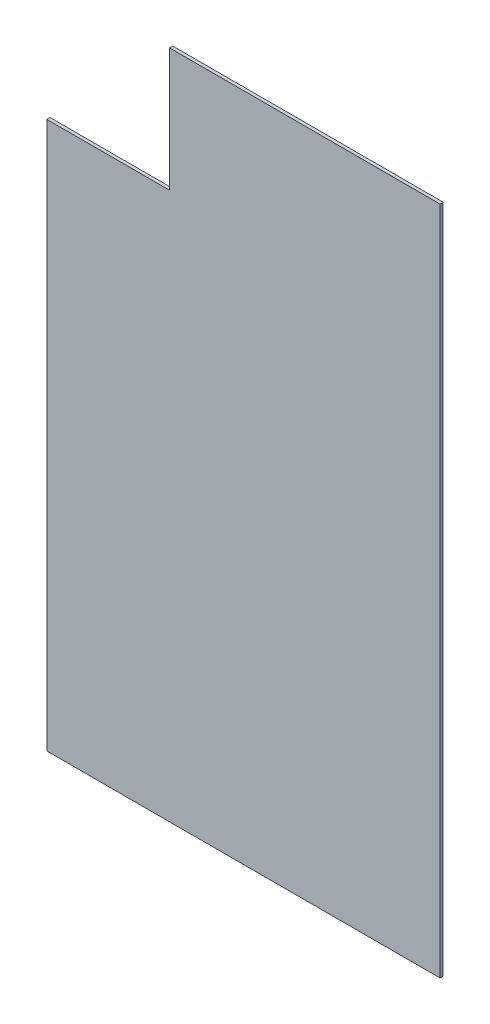
ISO-10303-21;
HEADER;
FILE_DESCRIPTION(('STEP AP214'),'2;1');
FILE_NAME('part.step','',(''),(''),'','','');
FILE_SCHEMA(('AUTOMOTIVE_DESIGN { 1 0 10303 214 1 1 1 1 }'));
ENDSEC;
DATA;
#1=APPLICATION_CONTEXT('core data for automotive mechanical design processes');
#2=APPLICATION_PROTOCOL_DEFINITION('international standard','automotive_design',2000,#1);
#3=PRODUCT_CONTEXT('',#1,'mechanical');
#4=PRODUCT('Part','Part','',(#3));
#5=PRODUCT_RELATED_PRODUCT_CATEGORY('part','',(#4));
#6=PRODUCT_DEFINITION_FORMATION('','',#4);
#7=PRODUCT_DEFINITION_CONTEXT('part definition',#1,'design');
#8=PRODUCT_DEFINITION('design','',#6,#7);
#9=PRODUCT_DEFINITION_SHAPE('','',#8);
#10=(LENGTH_UNIT() NAMED_UNIT(*) SI_UNIT(.MILLI.,.METRE.));
#11=(NAMED_UNIT(*) PLANE_ANGLE_UNIT() SI_UNIT($,.RADIAN.));
#12=(NAMED_UNIT(*) SI_UNIT($,.STERADIAN.) SOLID_ANGLE_UNIT());
#13=UNCERTAINTY_MEASURE_WITH_UNIT(LENGTH_MEASURE(1.E-05),#10,'distance_accuracy_value','');
#14=(GEOMETRIC_REPRESENTATION_CONTEXT(3) GLOBAL_UNCERTAINTY_ASSIGNED_CONTEXT((#13)) GLOBAL_UNIT_ASSIGNED_CONTEXT((#10,
#11,#12)) REPRESENTATION_CONTEXT('',''));
#15=CARTESIAN_POINT('',(0.,0.,0.));
#16=DIRECTION('',(0.,0.,1.));
#17=DIRECTION('',(1.,0.,0.));
#18=AXIS2_PLACEMENT_3D('',#15,#16,#17);
#19=CARTESIAN_POINT('',(1474.,0.,-12.));
#20=DIRECTION('',(0.,-1.,0.));
#21=DIRECTION('',(1.,0.,0.));
#22=AXIS2_PLACEMENT_3D('',#19,#20,#21);
#23=PLANE('',#22);
#24=DIRECTION('',(1.,0.,0.));
#25=VECTOR('',#24,1.);
#26=CARTESIAN_POINT('',(1474.,0.,0.));
#27=LINE('',#26,#25);
#28=CARTESIAN_POINT('',(0.,0.,0.));
#29=VERTEX_POINT('',#28);
#30=CARTESIAN_POINT('',(1474.,0.,0.));
#31=VERTEX_POINT('',#30);
#32=EDGE_CURVE('E123',#29,#31,#27,.T.);
#33=ORIENTED_EDGE('',*,*,#32,.F.);
#34=DIRECTION('',(0.,0.,1.));
#35=VECTOR('',#34,1.);
#36=CARTESIAN_POINT('',(0.,0.,-12.));
#37=LINE('',#36,#35);
#38=CARTESIAN_POINT('',(0.,0.,-12.));
#39=VERTEX_POINT('',#38);
#40=EDGE_CURVE('E11',#39,#29,#37,.T.);
#41=ORIENTED_EDGE('',*,*,#40,.F.);
#42=DIRECTION('',(1.,0.,0.));
#43=VECTOR('',#42,1.);
#44=CARTESIAN_POINT('',(1474.,0.,-12.));
#45=LINE('',#44,#43);
#46=CARTESIAN_POINT('',(1474.,0.,-12.));
#47=VERTEX_POINT('',#46);
#48=EDGE_CURVE('E137',#39,#47,#45,.T.);
#49=ORIENTED_EDGE('',*,*,#48,.T.);
#50=DIRECTION('',(0.,0.,1.));
#51=VECTOR('',#50,1.);
#52=CARTESIAN_POINT('',(1474.,0.,-12.));
#53=LINE('',#52,#51);
#54=EDGE_CURVE('E41',#47,#31,#53,.T.);
#55=ORIENTED_EDGE('',*,*,#54,.T.);
#56=EDGE_LOOP('',(#33,#41,#49,#55));
#57=FACE_BOUND('',#56,.T.);
#58=ADVANCED_FACE('F38',(#57),#23,.T.);
#59=CARTESIAN_POINT('',(0.,0.,-12.));
#60=DIRECTION('',(-1.,0.,0.));
#61=DIRECTION('',(0.,0.,1.));
#62=AXIS2_PLACEMENT_3D('',#59,#60,#61);
#63=PLANE('',#62);
#64=DIRECTION('',(0.,-1.,0.));
#65=VECTOR('',#64,1.);
#66=CARTESIAN_POINT('',(0.,0.,0.));
#67=LINE('',#66,#65);
#68=CARTESIAN_POINT('',(0.,2050.,0.));
#69=VERTEX_POINT('',#68);
#70=EDGE_CURVE('E135',#69,#29,#67,.T.);
#71=ORIENTED_EDGE('',*,*,#70,.F.);
#72=DIRECTION('',(0.,0.,1.));
#73=VECTOR('',#72,1.);
#74=CARTESIAN_POINT('',(0.,2050.,-12.));
#75=LINE('',#74,#73);
#76=CARTESIAN_POINT('',(0.,2050.,-12.));
#77=VERTEX_POINT('',#76);
#78=EDGE_CURVE('E47',#77,#69,#75,.T.);
#79=ORIENTED_EDGE('',*,*,#78,.F.);
#80=DIRECTION('',(0.,-1.,0.));
#81=VECTOR('',#80,1.);
#82=CARTESIAN_POINT('',(0.,0.,-12.));
#83=LINE('',#82,#81);
#84=EDGE_CURVE('E113',#77,#39,#83,.T.);
#85=ORIENTED_EDGE('',*,*,#84,.T.);
#86=ORIENTED_EDGE('',*,*,#40,.T.);
#87=EDGE_LOOP('',(#71,#79,#85,#86));
#88=FACE_BOUND('',#87,.T.);
#89=ADVANCED_FACE('F145',(#88),#63,.T.);
#90=CARTESIAN_POINT('',(0.,2050.,-12.));
#91=DIRECTION('',(0.,1.,0.));
#92=DIRECTION('',(0.,0.,1.));
#93=AXIS2_PLACEMENT_3D('',#90,#91,#92);
#94=PLANE('',#93);
#95=DIRECTION('',(-1.,0.,0.));
#96=VECTOR('',#95,1.);
#97=CARTESIAN_POINT('',(0.,2050.,0.));
#98=LINE('',#97,#96);
#99=CARTESIAN_POINT('',(460.,2050.,0.));
#100=VERTEX_POINT('',#99);
#101=EDGE_CURVE('E100',#100,#69,#98,.T.);
#102=ORIENTED_EDGE('',*,*,#101,.F.);
#103=DIRECTION('',(0.,0.,1.));
#104=VECTOR('',#103,1.);
#105=CARTESIAN_POINT('',(460.,2050.,-12.));
#106=LINE('',#105,#104);
#107=CARTESIAN_POINT('',(460.,2050.,-12.));
#108=VERTEX_POINT('',#107);
#109=EDGE_CURVE('E95',#108,#100,#106,.T.);
#110=ORIENTED_EDGE('',*,*,#109,.F.);
#111=DIRECTION('',(-1.,0.,0.));
#112=VECTOR('',#111,1.);
#113=CARTESIAN_POINT('',(0.,2050.,-12.));
#114=LINE('',#113,#112);
#115=EDGE_CURVE('E98',#108,#77,#114,.T.);
#116=ORIENTED_EDGE('',*,*,#115,.T.);
#117=ORIENTED_EDGE('',*,*,#78,.T.);
#118=EDGE_LOOP('',(#102,#110,#116,#117));
#119=FACE_BOUND('',#118,.T.);
#120=ADVANCED_FACE('F97',(#119),#94,.T.);
#121=CARTESIAN_POINT('',(460.,2050.,-12.));
#122=DIRECTION('',(-1.,0.,0.));
#123=DIRECTION('',(0.,0.,1.));
#124=AXIS2_PLACEMENT_3D('',#121,#122,#123);
#125=PLANE('',#124);
#126=DIRECTION('',(0.,-1.,0.));
#127=VECTOR('',#126,1.);
#128=CARTESIAN_POINT('',(460.,2050.,0.));
#129=LINE('',#128,#127);
#130=CARTESIAN_POINT('',(460.,2512.,0.));
#131=VERTEX_POINT('',#130);
#132=EDGE_CURVE('E132',#131,#100,#129,.T.);
#133=ORIENTED_EDGE('',*,*,#132,.F.);
#134=DIRECTION('',(0.,0.,1.));
#135=VECTOR('',#134,1.);
#136=CARTESIAN_POINT('',(460.,2512.,-12.));
#137=LINE('',#136,#135);
#138=CARTESIAN_POINT('',(460.,2512.,-12.));
#139=VERTEX_POINT('',#138);
#140=EDGE_CURVE('E105',#139,#131,#137,.T.);
#141=ORIENTED_EDGE('',*,*,#140,.F.);
#142=DIRECTION('',(0.,-1.,0.));
#143=VECTOR('',#142,1.);
#144=CARTESIAN_POINT('',(460.,2050.,-12.));
#145=LINE('',#144,#143);
#146=EDGE_CURVE('E111',#139,#108,#145,.T.);
#147=ORIENTED_EDGE('',*,*,#146,.T.);
#148=ORIENTED_EDGE('',*,*,#109,.T.);
#149=EDGE_LOOP('',(#133,#141,#147,#148));
#150=FACE_BOUND('',#149,.T.);
#151=ADVANCED_FACE('F115',(#150),#125,.T.);
#152=CARTESIAN_POINT('',(460.,2512.,-12.));
#153=DIRECTION('',(0.,1.,0.));
#154=DIRECTION('',(0.,0.,1.));
#155=AXIS2_PLACEMENT_3D('',#152,#153,#154);
#156=PLANE('',#155);
#157=DIRECTION('',(-1.,0.,0.));
#158=VECTOR('',#157,1.);
#159=CARTESIAN_POINT('',(460.,2512.,0.));
#160=LINE('',#159,#158);
#161=CARTESIAN_POINT('',(1474.,2512.,0.));
#162=VERTEX_POINT('',#161);
#163=EDGE_CURVE('E129',#162,#131,#160,.T.);
#164=ORIENTED_EDGE('',*,*,#163,.F.);
#165=DIRECTION('',(0.,0.,1.));
#166=VECTOR('',#165,1.);
#167=CARTESIAN_POINT('',(1474.,2512.,-12.));
#168=LINE('',#167,#166);
#169=CARTESIAN_POINT('',(1474.,2512.,-12.));
#170=VERTEX_POINT('',#169);
#171=EDGE_CURVE('E140',#170,#162,#168,.T.);
#172=ORIENTED_EDGE('',*,*,#171,.F.);
#173=DIRECTION('',(-1.,0.,0.));
#174=VECTOR('',#173,1.);
#175=CARTESIAN_POINT('',(460.,2512.,-12.));
#176=LINE('',#175,#174);
#177=EDGE_CURVE('E116',#170,#139,#176,.T.);
#178=ORIENTED_EDGE('',*,*,#177,.T.);
#179=ORIENTED_EDGE('',*,*,#140,.T.);
#180=EDGE_LOOP('',(#164,#172,#178,#179));
#181=FACE_BOUND('',#180,.T.);
#182=ADVANCED_FACE('F158',(#181),#156,.T.);
#183=CARTESIAN_POINT('',(1474.,2512.,-12.));
#184=DIRECTION('',(1.,0.,0.));
#185=DIRECTION('',(0.,1.,0.));
#186=AXIS2_PLACEMENT_3D('',#183,#184,#185);
#187=PLANE('',#186);
#188=DIRECTION('',(0.,1.,0.));
#189=VECTOR('',#188,1.);
#190=CARTESIAN_POINT('',(1474.,2512.,0.));
#191=LINE('',#190,#189);
#192=EDGE_CURVE('E126',#31,#162,#191,.T.);
#193=ORIENTED_EDGE('',*,*,#192,.F.);
#194=ORIENTED_EDGE('',*,*,#54,.F.);
#195=DIRECTION('',(0.,1.,0.));
#196=VECTOR('',#195,1.);
#197=CARTESIAN_POINT('',(1474.,2512.,-12.));
#198=LINE('',#197,#196);
#199=EDGE_CURVE('E118',#47,#170,#198,.T.);
#200=ORIENTED_EDGE('',*,*,#199,.T.);
#201=ORIENTED_EDGE('',*,*,#171,.T.);
#202=EDGE_LOOP('',(#193,#194,#200,#201));
#203=FACE_BOUND('',#202,.T.);
#204=ADVANCED_FACE('F142',(#203),#187,.T.);
#205=CARTESIAN_POINT('',(0.,0.,-12.));
#206=DIRECTION('',(0.,0.,-1.));
#207=DIRECTION('',(-1.,0.,0.));
#208=AXIS2_PLACEMENT_3D('',#205,#206,#207);
#209=PLANE('',#208);
#210=ORIENTED_EDGE('',*,*,#48,.F.);
#211=ORIENTED_EDGE('',*,*,#84,.F.);
#212=ORIENTED_EDGE('',*,*,#115,.F.);
#213=ORIENTED_EDGE('',*,*,#146,.F.);
#214=ORIENTED_EDGE('',*,*,#177,.F.);
#215=ORIENTED_EDGE('',*,*,#199,.F.);
#216=EDGE_LOOP('',(#210,#211,#212,#213,#214,#215));
#217=FACE_BOUND('',#216,.T.);
#218=ADVANCED_FACE('F109',(#217),#209,.T.);
#219=CARTESIAN_POINT('',(0.,0.,0.));
#220=DIRECTION('',(0.,0.,-1.));
#221=DIRECTION('',(-1.,0.,0.));
#222=AXIS2_PLACEMENT_3D('',#219,#220,#221);
#223=PLANE('',#222);
#224=ORIENTED_EDGE('',*,*,#32,.T.);
#225=ORIENTED_EDGE('',*,*,#192,.T.);
#226=ORIENTED_EDGE('',*,*,#163,.T.);
#227=ORIENTED_EDGE('',*,*,#132,.T.);
#228=ORIENTED_EDGE('',*,*,#101,.T.);
#229=ORIENTED_EDGE('',*,*,#70,.T.);
#230=EDGE_LOOP('',(#224,#225,#226,#227,#228,#229));
#231=FACE_BOUND('',#230,.T.);
#232=ADVANCED_FACE('F144',(#231),#223,.F.);
#233=CLOSED_SHELL('',(#58,#89,#120,#151,#182,#204,#218,#232));
#234=MANIFOLD_SOLID_BREP('B2',#233);
#235=ADVANCED_BREP_SHAPE_REPRESENTATION('',(#18,#234),#14);
#236=SHAPE_DEFINITION_REPRESENTATION(#9,#235);
ENDSEC;
END-ISO-10303-21;
